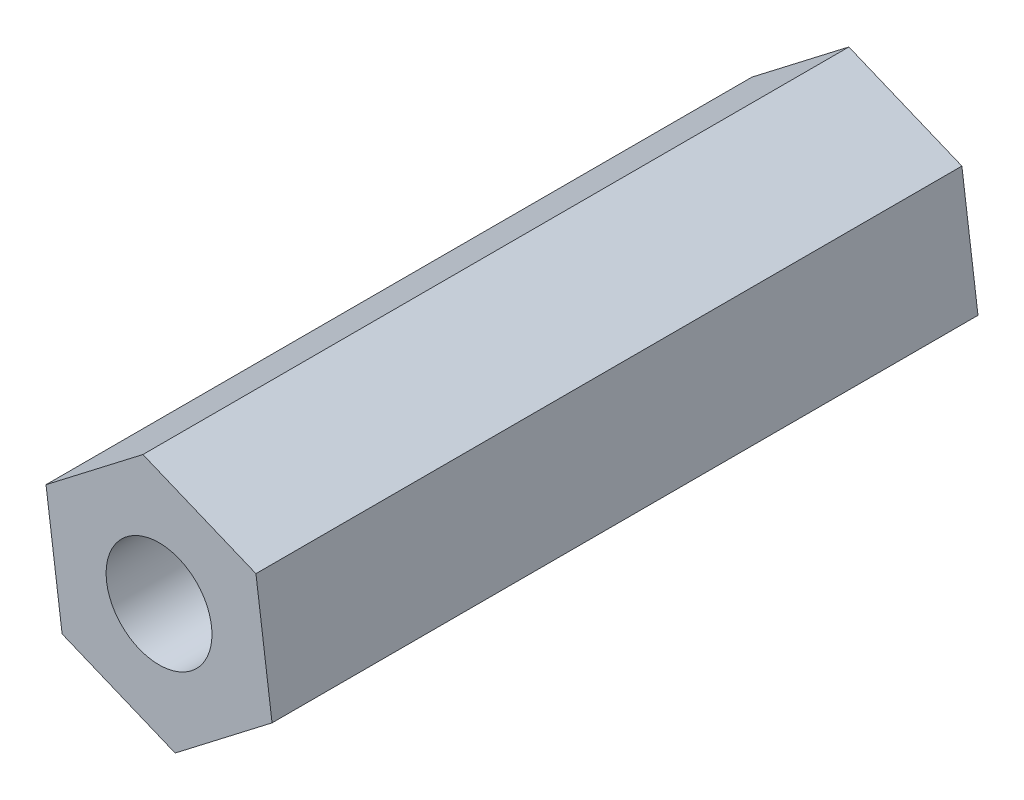
ISO-10303-21;
HEADER;
FILE_DESCRIPTION(('STEP AP214'),'2;1');
FILE_NAME('part.step','',(''),(''),'','','');
FILE_SCHEMA(('AUTOMOTIVE_DESIGN { 1 0 10303 214 1 1 1 1 }'));
ENDSEC;
DATA;
#1=APPLICATION_CONTEXT('core data for automotive mechanical design processes');
#2=APPLICATION_PROTOCOL_DEFINITION('international standard','automotive_design',2000,#1);
#3=PRODUCT_CONTEXT('',#1,'mechanical');
#4=PRODUCT('Part','Part','',(#3));
#5=PRODUCT_RELATED_PRODUCT_CATEGORY('part','',(#4));
#6=PRODUCT_DEFINITION_FORMATION('','',#4);
#7=PRODUCT_DEFINITION_CONTEXT('part definition',#1,'design');
#8=PRODUCT_DEFINITION('design','',#6,#7);
#9=PRODUCT_DEFINITION_SHAPE('','',#8);
#10=(LENGTH_UNIT() NAMED_UNIT(*) SI_UNIT(.MILLI.,.METRE.));
#11=(NAMED_UNIT(*) PLANE_ANGLE_UNIT() SI_UNIT($,.RADIAN.));
#12=(NAMED_UNIT(*) SI_UNIT($,.STERADIAN.) SOLID_ANGLE_UNIT());
#13=UNCERTAINTY_MEASURE_WITH_UNIT(LENGTH_MEASURE(1.E-05),#10,'distance_accuracy_value','');
#14=(GEOMETRIC_REPRESENTATION_CONTEXT(3) GLOBAL_UNCERTAINTY_ASSIGNED_CONTEXT((#13)) GLOBAL_UNIT_ASSIGNED_CONTEXT((#10,
#11,#12)) REPRESENTATION_CONTEXT('',''));
#15=CARTESIAN_POINT('',(0.,0.,0.));
#16=DIRECTION('',(0.,0.,1.));
#17=DIRECTION('',(1.,0.,0.));
#18=AXIS2_PLACEMENT_3D('',#15,#16,#17);
#19=CARTESIAN_POINT('',(9.19055193256126,-4.42485333054905,20.));
#20=DIRECTION('',(-0.9912718247363,-0.131833870776693,0.));
#21=DIRECTION('',(0.131833870776693,-0.9912718247363,0.));
#22=AXIS2_PLACEMENT_3D('',#19,#20,#21);
#23=PLANE('',#22);
#24=DIRECTION('',(-0.131833870776693,0.9912718247363,0.));
#25=VECTOR('',#24,1.);
#26=CARTESIAN_POINT('',(9.19055193256126,-4.42485333054905,0.));
#27=LINE('',#26,#25);
#28=CARTESIAN_POINT('',(9.19055193256126,-4.42485333054905,0.));
#29=VERTEX_POINT('',#28);
#30=CARTESIAN_POINT('',(8.73386600787386,-0.990987001439481,0.));
#31=VERTEX_POINT('',#30);
#32=EDGE_CURVE('E116',#29,#31,#27,.T.);
#33=ORIENTED_EDGE('',*,*,#32,.T.);
#34=DIRECTION('',(0.,0.,-1.));
#35=VECTOR('',#34,1.);
#36=CARTESIAN_POINT('',(8.73386600787386,-0.990987001439481,20.));
#37=LINE('',#36,#35);
#38=CARTESIAN_POINT('',(8.73386600787386,-0.990987001439481,20.));
#39=VERTEX_POINT('',#38);
#40=EDGE_CURVE('E11',#39,#31,#37,.T.);
#41=ORIENTED_EDGE('',*,*,#40,.F.);
#42=DIRECTION('',(-0.131833870776693,0.9912718247363,0.));
#43=VECTOR('',#42,1.);
#44=CARTESIAN_POINT('',(9.19055193256126,-4.42485333054905,20.));
#45=LINE('',#44,#43);
#46=CARTESIAN_POINT('',(9.19055193256126,-4.42485333054905,20.));
#47=VERTEX_POINT('',#46);
#48=EDGE_CURVE('E127',#47,#39,#45,.T.);
#49=ORIENTED_EDGE('',*,*,#48,.F.);
#50=DIRECTION('',(0.,0.,-1.));
#51=VECTOR('',#50,1.);
#52=CARTESIAN_POINT('',(9.19055193256126,-4.42485333054905,20.));
#53=LINE('',#52,#51);
#54=EDGE_CURVE('E112',#47,#29,#53,.T.);
#55=ORIENTED_EDGE('',*,*,#54,.T.);
#56=EDGE_LOOP('',(#33,#41,#49,#55));
#57=FACE_BOUND('',#56,.T.);
#58=ADVANCED_FACE('F32',(#57),#23,.F.);
#59=CARTESIAN_POINT('',(8.73386600787386,-0.990987001439481,20.));
#60=DIRECTION('',(-0.381464431196299,-0.924383517665738,0.));
#61=DIRECTION('',(0.924383517665738,-0.381464431196299,0.));
#62=AXIS2_PLACEMENT_3D('',#59,#60,#61);
#63=PLANE('',#62);
#64=DIRECTION('',(-0.924383517665738,0.381464431196299,0.));
#65=VECTOR('',#64,1.);
#66=CARTESIAN_POINT('',(8.73386600787386,-0.990987001439481,0.));
#67=LINE('',#66,#65);
#68=CARTESIAN_POINT('',(5.53170757132126,0.330444550785222,0.));
#69=VERTEX_POINT('',#68);
#70=EDGE_CURVE('E119',#31,#69,#67,.T.);
#71=ORIENTED_EDGE('',*,*,#70,.T.);
#72=DIRECTION('',(0.,0.,-1.));
#73=VECTOR('',#72,1.);
#74=CARTESIAN_POINT('',(5.53170757132126,0.330444550785222,20.));
#75=LINE('',#74,#73);
#76=CARTESIAN_POINT('',(5.53170757132126,0.330444550785222,20.));
#77=VERTEX_POINT('',#76);
#78=EDGE_CURVE('E40',#77,#69,#75,.T.);
#79=ORIENTED_EDGE('',*,*,#78,.F.);
#80=DIRECTION('',(-0.924383517665738,0.381464431196299,0.));
#81=VECTOR('',#80,1.);
#82=CARTESIAN_POINT('',(8.73386600787386,-0.990987001439481,20.));
#83=LINE('',#82,#81);
#84=EDGE_CURVE('E85',#39,#77,#83,.T.);
#85=ORIENTED_EDGE('',*,*,#84,.F.);
#86=ORIENTED_EDGE('',*,*,#40,.T.);
#87=EDGE_LOOP('',(#71,#79,#85,#86));
#88=FACE_BOUND('',#87,.T.);
#89=ADVANCED_FACE('F152',(#88),#63,.F.);
#90=CARTESIAN_POINT('',(5.53170757132126,0.330444550785222,20.));
#91=DIRECTION('',(0.609807393540002,-0.792549646889045,0.));
#92=DIRECTION('',(0.792549646889045,0.609807393540002,0.));
#93=AXIS2_PLACEMENT_3D('',#90,#91,#92);
#94=PLANE('',#93);
#95=DIRECTION('',(-0.792549646889045,-0.609807393540002,0.));
#96=VECTOR('',#95,1.);
#97=CARTESIAN_POINT('',(5.53170757132126,0.330444550785222,0.));
#98=LINE('',#97,#96);
#99=CARTESIAN_POINT('',(2.78623505945606,-1.78199022609964,0.));
#100=VERTEX_POINT('',#99);
#101=EDGE_CURVE('E122',#69,#100,#98,.T.);
#102=ORIENTED_EDGE('',*,*,#101,.T.);
#103=DIRECTION('',(0.,0.,-1.));
#104=VECTOR('',#103,1.);
#105=CARTESIAN_POINT('',(2.78623505945606,-1.78199022609964,20.));
#106=LINE('',#105,#104);
#107=CARTESIAN_POINT('',(2.78623505945606,-1.78199022609964,20.));
#108=VERTEX_POINT('',#107);
#109=EDGE_CURVE('E107',#108,#100,#106,.T.);
#110=ORIENTED_EDGE('',*,*,#109,.F.);
#111=DIRECTION('',(-0.792549646889045,-0.609807393540002,0.));
#112=VECTOR('',#111,1.);
#113=CARTESIAN_POINT('',(5.53170757132126,0.330444550785222,20.));
#114=LINE('',#113,#112);
#115=EDGE_CURVE('E98',#77,#108,#114,.T.);
#116=ORIENTED_EDGE('',*,*,#115,.F.);
#117=ORIENTED_EDGE('',*,*,#78,.T.);
#118=EDGE_LOOP('',(#102,#110,#116,#117));
#119=FACE_BOUND('',#118,.T.);
#120=ADVANCED_FACE('F133',(#119),#94,.F.);
#121=CARTESIAN_POINT('',(2.78623505945606,-1.78199022609964,20.));
#122=DIRECTION('',(0.9912718247363,0.131833870776694,0.));
#123=DIRECTION('',(-0.131833870776693,0.9912718247363,0.));
#124=AXIS2_PLACEMENT_3D('',#121,#122,#123);
#125=PLANE('',#124);
#126=DIRECTION('',(0.131833870776694,-0.9912718247363,0.));
#127=VECTOR('',#126,1.);
#128=CARTESIAN_POINT('',(2.78623505945606,-1.78199022609964,0.));
#129=LINE('',#128,#127);
#130=CARTESIAN_POINT('',(3.24292098414346,-5.21585655520921,0.));
#131=VERTEX_POINT('',#130);
#132=EDGE_CURVE('E106',#100,#131,#129,.T.);
#133=ORIENTED_EDGE('',*,*,#132,.T.);
#134=DIRECTION('',(0.,0.,-1.));
#135=VECTOR('',#134,1.);
#136=CARTESIAN_POINT('',(3.24292098414346,-5.21585655520921,20.));
#137=LINE('',#136,#135);
#138=CARTESIAN_POINT('',(3.24292098414346,-5.21585655520921,20.));
#139=VERTEX_POINT('',#138);
#140=EDGE_CURVE('E103',#139,#131,#137,.T.);
#141=ORIENTED_EDGE('',*,*,#140,.F.);
#142=DIRECTION('',(0.131833870776694,-0.9912718247363,0.));
#143=VECTOR('',#142,1.);
#144=CARTESIAN_POINT('',(2.78623505945606,-1.78199022609964,20.));
#145=LINE('',#144,#143);
#146=EDGE_CURVE('E92',#108,#139,#145,.T.);
#147=ORIENTED_EDGE('',*,*,#146,.F.);
#148=ORIENTED_EDGE('',*,*,#109,.T.);
#149=EDGE_LOOP('',(#133,#141,#147,#148));
#150=FACE_BOUND('',#149,.T.);
#151=ADVANCED_FACE('F104',(#150),#125,.F.);
#152=CARTESIAN_POINT('',(3.24292098414346,-5.21585655520921,20.));
#153=DIRECTION('',(0.381464431196299,0.924383517665738,0.));
#154=DIRECTION('',(-0.924383517665738,0.381464431196299,0.));
#155=AXIS2_PLACEMENT_3D('',#152,#153,#154);
#156=PLANE('',#155);
#157=DIRECTION('',(0.924383517665738,-0.381464431196299,0.));
#158=VECTOR('',#157,1.);
#159=CARTESIAN_POINT('',(3.24292098414346,-5.21585655520921,0.));
#160=LINE('',#159,#158);
#161=CARTESIAN_POINT('',(6.44507942069607,-6.53728810743391,0.));
#162=VERTEX_POINT('',#161);
#163=EDGE_CURVE('E71',#131,#162,#160,.T.);
#164=ORIENTED_EDGE('',*,*,#163,.T.);
#165=DIRECTION('',(0.,0.,-1.));
#166=VECTOR('',#165,1.);
#167=CARTESIAN_POINT('',(6.44507942069607,-6.53728810743391,20.));
#168=LINE('',#167,#166);
#169=CARTESIAN_POINT('',(6.44507942069607,-6.53728810743391,20.));
#170=VERTEX_POINT('',#169);
#171=EDGE_CURVE('E108',#170,#162,#168,.T.);
#172=ORIENTED_EDGE('',*,*,#171,.F.);
#173=DIRECTION('',(0.924383517665738,-0.381464431196299,0.));
#174=VECTOR('',#173,1.);
#175=CARTESIAN_POINT('',(3.24292098414346,-5.21585655520921,20.));
#176=LINE('',#175,#174);
#177=EDGE_CURVE('E96',#139,#170,#176,.T.);
#178=ORIENTED_EDGE('',*,*,#177,.F.);
#179=ORIENTED_EDGE('',*,*,#140,.T.);
#180=EDGE_LOOP('',(#164,#172,#178,#179));
#181=FACE_BOUND('',#180,.T.);
#182=ADVANCED_FACE('F110',(#181),#156,.F.);
#183=CARTESIAN_POINT('',(6.44507942069607,-6.53728810743391,20.));
#184=DIRECTION('',(-0.609807393540002,0.792549646889045,0.));
#185=DIRECTION('',(-0.792549646889045,-0.609807393540002,0.));
#186=AXIS2_PLACEMENT_3D('',#183,#184,#185);
#187=PLANE('',#186);
#188=DIRECTION('',(0.792549646889045,0.609807393540002,0.));
#189=VECTOR('',#188,1.);
#190=CARTESIAN_POINT('',(6.44507942069607,-6.53728810743391,0.));
#191=LINE('',#190,#189);
#192=EDGE_CURVE('E77',#162,#29,#191,.T.);
#193=ORIENTED_EDGE('',*,*,#192,.T.);
#194=ORIENTED_EDGE('',*,*,#54,.F.);
#195=DIRECTION('',(0.792549646889045,0.609807393540002,0.));
#196=VECTOR('',#195,1.);
#197=CARTESIAN_POINT('',(6.44507942069607,-6.53728810743391,20.));
#198=LINE('',#197,#196);
#199=EDGE_CURVE('E48',#170,#47,#198,.T.);
#200=ORIENTED_EDGE('',*,*,#199,.F.);
#201=ORIENTED_EDGE('',*,*,#171,.T.);
#202=EDGE_LOOP('',(#193,#194,#200,#201));
#203=FACE_BOUND('',#202,.T.);
#204=ADVANCED_FACE('F140',(#203),#187,.F.);
#205=CARTESIAN_POINT('',(0.,0.,20.));
#206=DIRECTION('',(0.,0.,1.));
#207=DIRECTION('',(1.,0.,0.));
#208=AXIS2_PLACEMENT_3D('',#205,#206,#207);
#209=PLANE('',#208);
#210=CARTESIAN_POINT('',(5.98827505845482,-3.10253123472263,20.));
#211=DIRECTION('',(0.,0.,-1.));
#212=DIRECTION('',(-1.,0.,0.));
#213=AXIS2_PLACEMENT_3D('',#210,#211,#212);
#214=CIRCLE('',#213,1.5);
#215=CARTESIAN_POINT('',(4.48827505845482,-3.10253123472263,20.));
#216=VERTEX_POINT('',#215);
#217=EDGE_CURVE('E120',#216,#216,#214,.T.);
#218=ORIENTED_EDGE('',*,*,#217,.T.);
#219=EDGE_LOOP('',(#218));
#220=FACE_BOUND('',#219,.T.);
#221=ORIENTED_EDGE('',*,*,#48,.T.);
#222=ORIENTED_EDGE('',*,*,#84,.T.);
#223=ORIENTED_EDGE('',*,*,#115,.T.);
#224=ORIENTED_EDGE('',*,*,#146,.T.);
#225=ORIENTED_EDGE('',*,*,#177,.T.);
#226=ORIENTED_EDGE('',*,*,#199,.T.);
#227=EDGE_LOOP('',(#221,#222,#223,#224,#225,#226));
#228=FACE_BOUND('',#227,.T.);
#229=ADVANCED_FACE('F94',(#220,#228),#209,.T.);
#230=CARTESIAN_POINT('',(0.,0.,0.));
#231=DIRECTION('',(0.,0.,1.));
#232=DIRECTION('',(1.,0.,0.));
#233=AXIS2_PLACEMENT_3D('',#230,#231,#232);
#234=PLANE('',#233);
#235=CARTESIAN_POINT('',(5.98827505845482,-3.10253123472263,0.));
#236=DIRECTION('',(0.,0.,-1.));
#237=DIRECTION('',(-1.,0.,0.));
#238=AXIS2_PLACEMENT_3D('',#235,#236,#237);
#239=CIRCLE('',#238,1.5);
#240=CARTESIAN_POINT('',(4.48827505845482,-3.10253123472263,0.));
#241=VERTEX_POINT('',#240);
#242=EDGE_CURVE('E207',#241,#241,#239,.T.);
#243=ORIENTED_EDGE('',*,*,#242,.F.);
#244=EDGE_LOOP('',(#243));
#245=FACE_BOUND('',#244,.T.);
#246=ORIENTED_EDGE('',*,*,#32,.F.);
#247=ORIENTED_EDGE('',*,*,#192,.F.);
#248=ORIENTED_EDGE('',*,*,#163,.F.);
#249=ORIENTED_EDGE('',*,*,#132,.F.);
#250=ORIENTED_EDGE('',*,*,#101,.F.);
#251=ORIENTED_EDGE('',*,*,#70,.F.);
#252=EDGE_LOOP('',(#246,#247,#248,#249,#250,#251));
#253=FACE_BOUND('',#252,.T.);
#254=ADVANCED_FACE('F136',(#245,#253),#234,.F.);
#255=CARTESIAN_POINT('',(5.98827505845482,-3.10253123472263,20.));
#256=DIRECTION('',(0.,0.,-1.));
#257=DIRECTION('',(-1.,0.,0.));
#258=AXIS2_PLACEMENT_3D('',#255,#256,#257);
#259=CYLINDRICAL_SURFACE('',#258,1.5);
#260=ORIENTED_EDGE('',*,*,#217,.F.);
#261=EDGE_LOOP('',(#260));
#262=FACE_BOUND('',#261,.T.);
#263=ORIENTED_EDGE('',*,*,#242,.T.);
#264=EDGE_LOOP('',(#263));
#265=FACE_BOUND('',#264,.T.);
#266=ADVANCED_FACE('F189',(#262,#265),#259,.F.);
#267=CLOSED_SHELL('',(#58,#89,#120,#151,#182,#204,#229,#254,#266));
#268=MANIFOLD_SOLID_BREP('B2',#267);
#269=ADVANCED_BREP_SHAPE_REPRESENTATION('',(#18,#268),#14);
#270=SHAPE_DEFINITION_REPRESENTATION(#9,#269);
ENDSEC;
END-ISO-10303-21;
